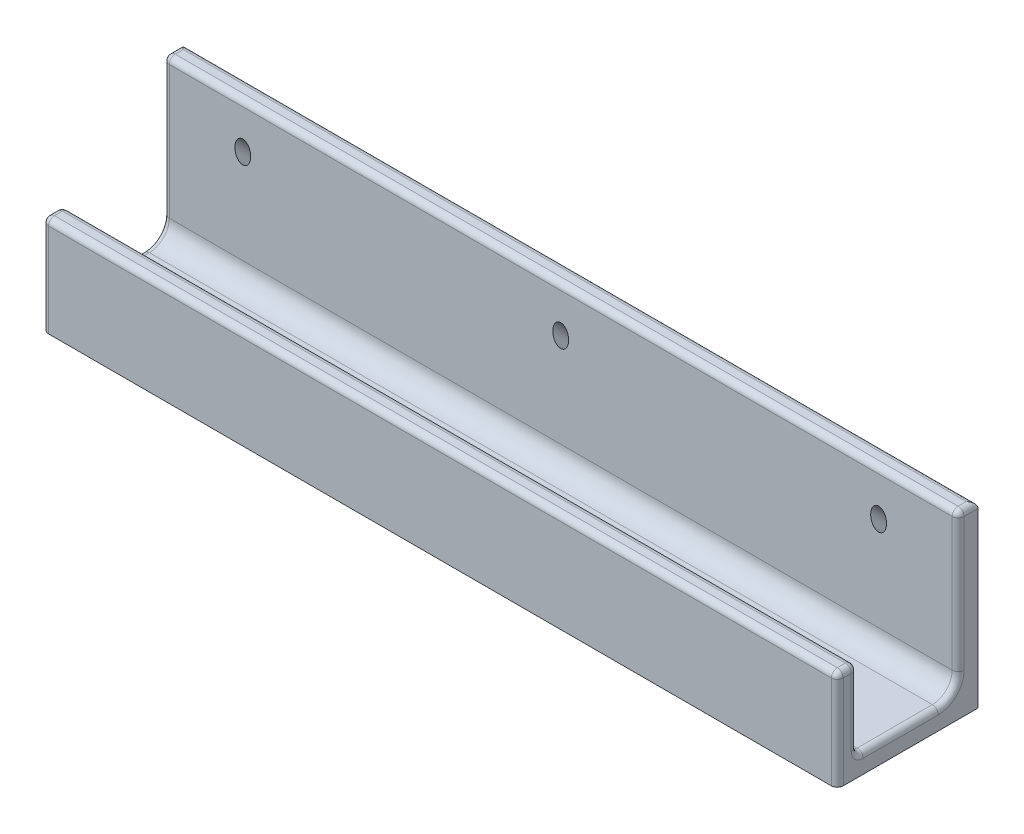
ISO-10303-21;
HEADER;
FILE_DESCRIPTION(('STEP AP214'),'2;1');
FILE_NAME('part.step','',(''),(''),'','','');
FILE_SCHEMA(('AUTOMOTIVE_DESIGN { 1 0 10303 214 1 1 1 1 }'));
ENDSEC;
DATA;
#1=APPLICATION_CONTEXT('core data for automotive mechanical design processes');
#2=APPLICATION_PROTOCOL_DEFINITION('international standard','automotive_design',2000,#1);
#3=PRODUCT_CONTEXT('',#1,'mechanical');
#4=PRODUCT('Part','Part','',(#3));
#5=PRODUCT_RELATED_PRODUCT_CATEGORY('part','',(#4));
#6=PRODUCT_DEFINITION_FORMATION('','',#4);
#7=PRODUCT_DEFINITION_CONTEXT('part definition',#1,'design');
#8=PRODUCT_DEFINITION('design','',#6,#7);
#9=PRODUCT_DEFINITION_SHAPE('','',#8);
#10=(LENGTH_UNIT() NAMED_UNIT(*) SI_UNIT(.MILLI.,.METRE.));
#11=(NAMED_UNIT(*) PLANE_ANGLE_UNIT() SI_UNIT($,.RADIAN.));
#12=(NAMED_UNIT(*) SI_UNIT($,.STERADIAN.) SOLID_ANGLE_UNIT());
#13=UNCERTAINTY_MEASURE_WITH_UNIT(LENGTH_MEASURE(1.E-05),#10,'distance_accuracy_value','');
#14=(GEOMETRIC_REPRESENTATION_CONTEXT(3) GLOBAL_UNCERTAINTY_ASSIGNED_CONTEXT((#13)) GLOBAL_UNIT_ASSIGNED_CONTEXT((#10,
#11,#12)) REPRESENTATION_CONTEXT('',''));
#15=CARTESIAN_POINT('',(0.,0.,0.));
#16=DIRECTION('',(0.,0.,1.));
#17=DIRECTION('',(1.,0.,0.));
#18=AXIS2_PLACEMENT_3D('',#15,#16,#17);
#19=CARTESIAN_POINT('',(100.,0.,-17.7));
#20=DIRECTION('',(0.,0.,1.));
#21=DIRECTION('',(1.,0.,0.));
#22=AXIS2_PLACEMENT_3D('',#19,#20,#21);
#23=PLANE('',#22);
#24=CARTESIAN_POINT('',(-80.,23.6862915010151,-17.7));
#25=DIRECTION('',(0.,0.,1.));
#26=DIRECTION('',(0.,1.,0.));
#27=AXIS2_PLACEMENT_3D('',#24,#25,#26);
#28=ELLIPSE('',#27,2.82842712474621,2.);
#29=CARTESIAN_POINT('',(-80.,26.5147186257613,-17.7));
#30=VERTEX_POINT('',#29);
#31=EDGE_CURVE('E399',#30,#30,#28,.T.);
#32=ORIENTED_EDGE('',*,*,#31,.T.);
#33=EDGE_LOOP('',(#32));
#34=FACE_BOUND('',#33,.T.);
#35=CARTESIAN_POINT('',(80.,23.6862915010152,-17.7));
#36=DIRECTION('',(0.,0.,1.));
#37=DIRECTION('',(0.,1.,0.));
#38=AXIS2_PLACEMENT_3D('',#35,#36,#37);
#39=ELLIPSE('',#38,2.82842712474621,2.);
#40=CARTESIAN_POINT('',(80.,26.5147186257614,-17.7));
#41=VERTEX_POINT('',#40);
#42=EDGE_CURVE('E409',#41,#41,#39,.T.);
#43=ORIENTED_EDGE('',*,*,#42,.T.);
#44=EDGE_LOOP('',(#43));
#45=FACE_BOUND('',#44,.T.);
#46=CARTESIAN_POINT('',(0.,23.6862915010151,-17.7));
#47=DIRECTION('',(0.,0.,1.));
#48=DIRECTION('',(0.,1.,0.));
#49=AXIS2_PLACEMENT_3D('',#46,#47,#48);
#50=ELLIPSE('',#49,2.8284271247462,2.);
#51=CARTESIAN_POINT('',(0.,26.5147186257613,-17.7));
#52=VERTEX_POINT('',#51);
#53=EDGE_CURVE('E416',#52,#52,#50,.T.);
#54=ORIENTED_EDGE('',*,*,#53,.T.);
#55=EDGE_LOOP('',(#54));
#56=FACE_BOUND('',#55,.T.);
#57=DIRECTION('',(0.,1.,0.));
#58=VECTOR('',#57,1.);
#59=CARTESIAN_POINT('',(-100.,0.,-17.7));
#60=LINE('',#59,#58);
#61=CARTESIAN_POINT('',(-100.,-5.,-17.7));
#62=VERTEX_POINT('',#61);
#63=CARTESIAN_POINT('',(-100.,38.5,-17.7));
#64=VERTEX_POINT('',#63);
#65=EDGE_CURVE('E212',#62,#64,#60,.T.);
#66=ORIENTED_EDGE('',*,*,#65,.T.);
#67=DIRECTION('',(-1.,0.,0.));
#68=VECTOR('',#67,1.);
#69=CARTESIAN_POINT('',(100.,38.5,-17.7));
#70=LINE('',#69,#68);
#71=CARTESIAN_POINT('',(100.,38.5,-17.7));
#72=VERTEX_POINT('',#71);
#73=EDGE_CURVE('E210',#64,#72,#70,.F.);
#74=ORIENTED_EDGE('',*,*,#73,.T.);
#75=DIRECTION('',(0.,1.,0.));
#76=VECTOR('',#75,1.);
#77=CARTESIAN_POINT('',(100.,0.,-17.7));
#78=LINE('',#77,#76);
#79=CARTESIAN_POINT('',(100.,-5.,-17.7));
#80=VERTEX_POINT('',#79);
#81=EDGE_CURVE('E192',#80,#72,#78,.T.);
#82=ORIENTED_EDGE('',*,*,#81,.F.);
#83=DIRECTION('',(-1.,0.,0.));
#84=VECTOR('',#83,1.);
#85=CARTESIAN_POINT('',(100.,-5.,-17.7));
#86=LINE('',#85,#84);
#87=EDGE_CURVE('E198',#80,#62,#86,.T.);
#88=ORIENTED_EDGE('',*,*,#87,.T.);
#89=EDGE_LOOP('',(#66,#74,#82,#88));
#90=FACE_BOUND('',#89,.T.);
#91=ADVANCED_FACE('F41',(#34,#45,#56,#90),#23,.F.);
#92=CARTESIAN_POINT('',(100.,40.,-12.7));
#93=DIRECTION('',(0.,1.,0.));
#94=DIRECTION('',(0.,0.,1.));
#95=AXIS2_PLACEMENT_3D('',#92,#93,#94);
#96=PLANE('',#95);
#97=DIRECTION('',(0.,0.,-1.));
#98=VECTOR('',#97,1.);
#99=CARTESIAN_POINT('',(98.5,40.,-17.7));
#100=LINE('',#99,#98);
#101=CARTESIAN_POINT('',(98.5,40.,-14.2));
#102=VERTEX_POINT('',#101);
#103=CARTESIAN_POINT('',(98.5,40.,-16.2));
#104=VERTEX_POINT('',#103);
#105=EDGE_CURVE('E293',#102,#104,#100,.T.);
#106=ORIENTED_EDGE('',*,*,#105,.T.);
#107=DIRECTION('',(-1.,0.,0.));
#108=VECTOR('',#107,1.);
#109=CARTESIAN_POINT('',(-100.,40.,-16.2));
#110=LINE('',#109,#108);
#111=CARTESIAN_POINT('',(-98.5,40.,-16.2));
#112=VERTEX_POINT('',#111);
#113=EDGE_CURVE('E295',#104,#112,#110,.T.);
#114=ORIENTED_EDGE('',*,*,#113,.T.);
#115=DIRECTION('',(0.,0.,-1.));
#116=VECTOR('',#115,1.);
#117=CARTESIAN_POINT('',(-98.5,40.,-12.7));
#118=LINE('',#117,#116);
#119=CARTESIAN_POINT('',(-98.5,40.,-14.2));
#120=VERTEX_POINT('',#119);
#121=EDGE_CURVE('E289',#112,#120,#118,.F.);
#122=ORIENTED_EDGE('',*,*,#121,.T.);
#123=DIRECTION('',(-1.,0.,0.));
#124=VECTOR('',#123,1.);
#125=CARTESIAN_POINT('',(100.,40.,-14.2));
#126=LINE('',#125,#124);
#127=EDGE_CURVE('E291',#120,#102,#126,.F.);
#128=ORIENTED_EDGE('',*,*,#127,.T.);
#129=EDGE_LOOP('',(#106,#114,#122,#128));
#130=FACE_BOUND('',#129,.T.);
#131=ADVANCED_FACE('F430',(#130),#96,.T.);
#132=CARTESIAN_POINT('',(100.,0.,-12.7));
#133=DIRECTION('',(0.,0.,1.));
#134=DIRECTION('',(1.,0.,0.));
#135=AXIS2_PLACEMENT_3D('',#132,#133,#134);
#136=PLANE('',#135);
#137=CARTESIAN_POINT('',(-80.,28.6862915010152,-12.7));
#138=DIRECTION('',(0.,0.,1.));
#139=DIRECTION('',(0.,1.,0.));
#140=AXIS2_PLACEMENT_3D('',#137,#138,#139);
#141=ELLIPSE('',#140,2.82842712474621,2.);
#142=CARTESIAN_POINT('',(-80.,31.5147186257614,-12.7));
#143=VERTEX_POINT('',#142);
#144=EDGE_CURVE('E404',#143,#143,#141,.T.);
#145=ORIENTED_EDGE('',*,*,#144,.F.);
#146=EDGE_LOOP('',(#145));
#147=FACE_BOUND('',#146,.T.);
#148=CARTESIAN_POINT('',(80.,28.6862915010152,-12.7));
#149=DIRECTION('',(0.,0.,1.));
#150=DIRECTION('',(0.,1.,0.));
#151=AXIS2_PLACEMENT_3D('',#148,#149,#150);
#152=ELLIPSE('',#151,2.82842712474621,2.);
#153=CARTESIAN_POINT('',(80.,31.5147186257614,-12.7));
#154=VERTEX_POINT('',#153);
#155=EDGE_CURVE('E414',#154,#154,#152,.T.);
#156=ORIENTED_EDGE('',*,*,#155,.F.);
#157=EDGE_LOOP('',(#156));
#158=FACE_BOUND('',#157,.T.);
#159=CARTESIAN_POINT('',(0.,28.6862915010152,-12.7));
#160=DIRECTION('',(0.,0.,1.));
#161=DIRECTION('',(0.,1.,0.));
#162=AXIS2_PLACEMENT_3D('',#159,#160,#161);
#163=ELLIPSE('',#162,2.8284271247462,2.);
#164=CARTESIAN_POINT('',(0.,31.5147186257614,-12.7));
#165=VERTEX_POINT('',#164);
#166=EDGE_CURVE('E215',#165,#165,#163,.T.);
#167=ORIENTED_EDGE('',*,*,#166,.F.);
#168=EDGE_LOOP('',(#167));
#169=FACE_BOUND('',#168,.T.);
#170=DIRECTION('',(-1.,0.,0.));
#171=VECTOR('',#170,1.);
#172=CARTESIAN_POINT('',(100.,38.5,-12.7));
#173=LINE('',#172,#171);
#174=CARTESIAN_POINT('',(98.5,38.5,-12.7));
#175=VERTEX_POINT('',#174);
#176=CARTESIAN_POINT('',(-98.5,38.5,-12.7));
#177=VERTEX_POINT('',#176);
#178=EDGE_CURVE('E301',#175,#177,#173,.T.);
#179=ORIENTED_EDGE('',*,*,#178,.T.);
#180=DIRECTION('',(0.,1.,0.));
#181=VECTOR('',#180,1.);
#182=CARTESIAN_POINT('',(-98.5,0.,-12.7));
#183=LINE('',#182,#181);
#184=CARTESIAN_POINT('',(-98.5,5.,-12.7));
#185=VERTEX_POINT('',#184);
#186=EDGE_CURVE('E303',#177,#185,#183,.F.);
#187=ORIENTED_EDGE('',*,*,#186,.T.);
#188=DIRECTION('',(-1.,0.,0.));
#189=VECTOR('',#188,1.);
#190=CARTESIAN_POINT('',(100.,5.,-12.7));
#191=LINE('',#190,#189);
#192=CARTESIAN_POINT('',(98.5,5.,-12.7));
#193=VERTEX_POINT('',#192);
#194=EDGE_CURVE('E223',#185,#193,#191,.F.);
#195=ORIENTED_EDGE('',*,*,#194,.T.);
#196=DIRECTION('',(0.,1.,0.));
#197=VECTOR('',#196,1.);
#198=CARTESIAN_POINT('',(98.5,40.,-12.7));
#199=LINE('',#198,#197);
#200=EDGE_CURVE('E299',#193,#175,#199,.T.);
#201=ORIENTED_EDGE('',*,*,#200,.T.);
#202=EDGE_LOOP('',(#179,#187,#195,#201));
#203=FACE_BOUND('',#202,.T.);
#204=ADVANCED_FACE('F426',(#147,#158,#169,#203),#136,.T.);
#205=CARTESIAN_POINT('',(100.,0.,0.));
#206=DIRECTION('',(0.,1.,0.));
#207=DIRECTION('',(0.,0.,1.));
#208=AXIS2_PLACEMENT_3D('',#205,#206,#207);
#209=PLANE('',#208);
#210=DIRECTION('',(-1.,0.,0.));
#211=VECTOR('',#210,1.);
#212=CARTESIAN_POINT('',(-100.,0.,-7.7));
#213=LINE('',#212,#211);
#214=CARTESIAN_POINT('',(98.5,0.,-7.7));
#215=VERTEX_POINT('',#214);
#216=CARTESIAN_POINT('',(-98.5,0.,-7.7));
#217=VERTEX_POINT('',#216);
#218=EDGE_CURVE('E221',#215,#217,#213,.T.);
#219=ORIENTED_EDGE('',*,*,#218,.T.);
#220=DIRECTION('',(0.,0.,-1.));
#221=VECTOR('',#220,1.);
#222=CARTESIAN_POINT('',(-98.5,0.,0.));
#223=LINE('',#222,#221);
#224=CARTESIAN_POINT('',(-98.5,0.,11.2));
#225=VERTEX_POINT('',#224);
#226=EDGE_CURVE('E11',#217,#225,#223,.F.);
#227=ORIENTED_EDGE('',*,*,#226,.T.);
#228=DIRECTION('',(-1.,0.,0.));
#229=VECTOR('',#228,1.);
#230=CARTESIAN_POINT('',(100.,0.,11.2));
#231=LINE('',#230,#229);
#232=CARTESIAN_POINT('',(98.5,0.,11.2));
#233=VERTEX_POINT('',#232);
#234=EDGE_CURVE('E50',#225,#233,#231,.F.);
#235=ORIENTED_EDGE('',*,*,#234,.T.);
#236=DIRECTION('',(0.,0.,-1.));
#237=VECTOR('',#236,1.);
#238=CARTESIAN_POINT('',(98.5,0.,-7.7));
#239=LINE('',#238,#237);
#240=EDGE_CURVE('E309',#233,#215,#239,.T.);
#241=ORIENTED_EDGE('',*,*,#240,.T.);
#242=EDGE_LOOP('',(#219,#227,#235,#241));
#243=FACE_BOUND('',#242,.T.);
#244=ADVANCED_FACE('F429',(#243),#209,.T.);
#245=CARTESIAN_POINT('',(100.,0.,12.7));
#246=DIRECTION('',(0.,0.,-1.));
#247=DIRECTION('',(-1.,0.,0.));
#248=AXIS2_PLACEMENT_3D('',#245,#246,#247);
#249=PLANE('',#248);
#250=DIRECTION('',(-1.,0.,0.));
#251=VECTOR('',#250,1.);
#252=CARTESIAN_POINT('',(-100.,1.5,12.7));
#253=LINE('',#252,#251);
#254=CARTESIAN_POINT('',(98.5,1.5,12.7));
#255=VERTEX_POINT('',#254);
#256=CARTESIAN_POINT('',(-98.5,1.5,12.7));
#257=VERTEX_POINT('',#256);
#258=EDGE_CURVE('E276',#255,#257,#253,.T.);
#259=ORIENTED_EDGE('',*,*,#258,.T.);
#260=DIRECTION('',(0.,-1.,0.));
#261=VECTOR('',#260,1.);
#262=CARTESIAN_POINT('',(-98.5,0.,12.7));
#263=LINE('',#262,#261);
#264=CARTESIAN_POINT('',(-98.5,18.5,12.7));
#265=VERTEX_POINT('',#264);
#266=EDGE_CURVE('E281',#257,#265,#263,.F.);
#267=ORIENTED_EDGE('',*,*,#266,.T.);
#268=DIRECTION('',(-1.,0.,0.));
#269=VECTOR('',#268,1.);
#270=CARTESIAN_POINT('',(100.,18.5,12.7));
#271=LINE('',#270,#269);
#272=CARTESIAN_POINT('',(98.5,18.5,12.7));
#273=VERTEX_POINT('',#272);
#274=EDGE_CURVE('E278',#265,#273,#271,.F.);
#275=ORIENTED_EDGE('',*,*,#274,.T.);
#276=DIRECTION('',(0.,-1.,0.));
#277=VECTOR('',#276,1.);
#278=CARTESIAN_POINT('',(98.5,0.,12.7));
#279=LINE('',#278,#277);
#280=EDGE_CURVE('E274',#273,#255,#279,.T.);
#281=ORIENTED_EDGE('',*,*,#280,.T.);
#282=EDGE_LOOP('',(#259,#267,#275,#281));
#283=FACE_BOUND('',#282,.T.);
#284=ADVANCED_FACE('F473',(#283),#249,.T.);
#285=CARTESIAN_POINT('',(100.,20.,17.7));
#286=DIRECTION('',(0.,1.,0.));
#287=DIRECTION('',(0.,0.,1.));
#288=AXIS2_PLACEMENT_3D('',#285,#286,#287);
#289=PLANE('',#288);
#290=DIRECTION('',(0.,0.,-1.));
#291=VECTOR('',#290,1.);
#292=CARTESIAN_POINT('',(98.5,20.,12.7));
#293=LINE('',#292,#291);
#294=CARTESIAN_POINT('',(98.5,20.,16.2));
#295=VERTEX_POINT('',#294);
#296=CARTESIAN_POINT('',(98.5,20.,14.2));
#297=VERTEX_POINT('',#296);
#298=EDGE_CURVE('E269',#295,#297,#293,.T.);
#299=ORIENTED_EDGE('',*,*,#298,.T.);
#300=DIRECTION('',(-1.,0.,0.));
#301=VECTOR('',#300,1.);
#302=CARTESIAN_POINT('',(100.,20.,14.2));
#303=LINE('',#302,#301);
#304=CARTESIAN_POINT('',(-98.5,20.,14.2));
#305=VERTEX_POINT('',#304);
#306=EDGE_CURVE('E271',#297,#305,#303,.T.);
#307=ORIENTED_EDGE('',*,*,#306,.T.);
#308=DIRECTION('',(0.,0.,-1.));
#309=VECTOR('',#308,1.);
#310=CARTESIAN_POINT('',(-98.5,20.,17.7));
#311=LINE('',#310,#309);
#312=CARTESIAN_POINT('',(-98.5,20.,16.2));
#313=VERTEX_POINT('',#312);
#314=EDGE_CURVE('E265',#305,#313,#311,.F.);
#315=ORIENTED_EDGE('',*,*,#314,.T.);
#316=DIRECTION('',(-1.,0.,0.));
#317=VECTOR('',#316,1.);
#318=CARTESIAN_POINT('',(100.,20.,16.2));
#319=LINE('',#318,#317);
#320=EDGE_CURVE('E267',#313,#295,#319,.F.);
#321=ORIENTED_EDGE('',*,*,#320,.T.);
#322=EDGE_LOOP('',(#299,#307,#315,#321));
#323=FACE_BOUND('',#322,.T.);
#324=ADVANCED_FACE('F495',(#323),#289,.T.);
#325=CARTESIAN_POINT('',(100.,0.,17.7));
#326=DIRECTION('',(0.,0.,-1.));
#327=DIRECTION('',(-1.,0.,0.));
#328=AXIS2_PLACEMENT_3D('',#325,#326,#327);
#329=PLANE('',#328);
#330=DIRECTION('',(-1.,0.,0.));
#331=VECTOR('',#330,1.);
#332=CARTESIAN_POINT('',(100.,-5.,17.7));
#333=LINE('',#332,#331);
#334=CARTESIAN_POINT('',(98.5,-5.,17.7));
#335=VERTEX_POINT('',#334);
#336=CARTESIAN_POINT('',(-98.5,-5.,17.7));
#337=VERTEX_POINT('',#336);
#338=EDGE_CURVE('E207',#335,#337,#333,.T.);
#339=ORIENTED_EDGE('',*,*,#338,.F.);
#340=DIRECTION('',(0.,-1.,0.));
#341=VECTOR('',#340,1.);
#342=CARTESIAN_POINT('',(98.5,0.,17.7));
#343=LINE('',#342,#341);
#344=CARTESIAN_POINT('',(98.5,18.5,17.7));
#345=VERTEX_POINT('',#344);
#346=EDGE_CURVE('E287',#335,#345,#343,.F.);
#347=ORIENTED_EDGE('',*,*,#346,.T.);
#348=DIRECTION('',(-1.,0.,0.));
#349=VECTOR('',#348,1.);
#350=CARTESIAN_POINT('',(-100.,18.5,17.7));
#351=LINE('',#350,#349);
#352=CARTESIAN_POINT('',(-98.5,18.5,17.7));
#353=VERTEX_POINT('',#352);
#354=EDGE_CURVE('E285',#345,#353,#351,.T.);
#355=ORIENTED_EDGE('',*,*,#354,.T.);
#356=DIRECTION('',(0.,-1.,0.));
#357=VECTOR('',#356,1.);
#358=CARTESIAN_POINT('',(-98.5,-5.,17.7));
#359=LINE('',#358,#357);
#360=EDGE_CURVE('E283',#353,#337,#359,.T.);
#361=ORIENTED_EDGE('',*,*,#360,.T.);
#362=EDGE_LOOP('',(#339,#347,#355,#361));
#363=FACE_BOUND('',#362,.T.);
#364=ADVANCED_FACE('F868',(#363),#329,.F.);
#365=CARTESIAN_POINT('',(100.,-5.,0.));
#366=DIRECTION('',(0.,1.,0.));
#367=DIRECTION('',(0.,0.,1.));
#368=AXIS2_PLACEMENT_3D('',#365,#366,#367);
#369=PLANE('',#368);
#370=DIRECTION('',(0.,0.,-1.));
#371=VECTOR('',#370,1.);
#372=CARTESIAN_POINT('',(100.,-5.,0.));
#373=LINE('',#372,#371);
#374=CARTESIAN_POINT('',(100.,-5.,16.2));
#375=VERTEX_POINT('',#374);
#376=EDGE_CURVE('E188',#375,#80,#373,.T.);
#377=ORIENTED_EDGE('',*,*,#376,.F.);
#378=CARTESIAN_POINT('',(98.5,-5.,16.2));
#379=DIRECTION('',(0.,1.,0.));
#380=DIRECTION('',(0.,0.,1.));
#381=AXIS2_PLACEMENT_3D('',#378,#379,#380);
#382=CIRCLE('',#381,1.5);
#383=EDGE_CURVE('E307',#375,#335,#382,.F.);
#384=ORIENTED_EDGE('',*,*,#383,.T.);
#385=ORIENTED_EDGE('',*,*,#338,.T.);
#386=CARTESIAN_POINT('',(-98.5,-5.,16.2));
#387=DIRECTION('',(0.,1.,0.));
#388=DIRECTION('',(0.,0.,1.));
#389=AXIS2_PLACEMENT_3D('',#386,#387,#388);
#390=CIRCLE('',#389,1.5);
#391=CARTESIAN_POINT('',(-100.,-5.,16.2));
#392=VERTEX_POINT('',#391);
#393=EDGE_CURVE('E305',#337,#392,#390,.F.);
#394=ORIENTED_EDGE('',*,*,#393,.T.);
#395=DIRECTION('',(0.,0.,-1.));
#396=VECTOR('',#395,1.);
#397=CARTESIAN_POINT('',(-100.,-5.,0.));
#398=LINE('',#397,#396);
#399=EDGE_CURVE('E203',#392,#62,#398,.T.);
#400=ORIENTED_EDGE('',*,*,#399,.T.);
#401=ORIENTED_EDGE('',*,*,#87,.F.);
#402=EDGE_LOOP('',(#377,#384,#385,#394,#400,#401));
#403=FACE_BOUND('',#402,.T.);
#404=ADVANCED_FACE('F201',(#403),#369,.F.);
#405=CARTESIAN_POINT('',(100.,0.,0.));
#406=DIRECTION('',(-1.,0.,0.));
#407=DIRECTION('',(0.,0.,1.));
#408=AXIS2_PLACEMENT_3D('',#405,#406,#407);
#409=PLANE('',#408);
#410=DIRECTION('',(0.,0.,-1.));
#411=VECTOR('',#410,1.);
#412=CARTESIAN_POINT('',(100.,18.5,17.7));
#413=LINE('',#412,#411);
#414=CARTESIAN_POINT('',(100.,18.5,14.2));
#415=VERTEX_POINT('',#414);
#416=CARTESIAN_POINT('',(100.,18.5,16.2));
#417=VERTEX_POINT('',#416);
#418=EDGE_CURVE('E262',#415,#417,#413,.F.);
#419=ORIENTED_EDGE('',*,*,#418,.T.);
#420=DIRECTION('',(0.,-1.,0.));
#421=VECTOR('',#420,1.);
#422=CARTESIAN_POINT('',(100.,0.,16.2));
#423=LINE('',#422,#421);
#424=EDGE_CURVE('E195',#417,#375,#423,.T.);
#425=ORIENTED_EDGE('',*,*,#424,.T.);
#426=ORIENTED_EDGE('',*,*,#376,.T.);
#427=ORIENTED_EDGE('',*,*,#81,.T.);
#428=DIRECTION('',(0.,0.,-1.));
#429=VECTOR('',#428,1.);
#430=CARTESIAN_POINT('',(100.,38.5,-12.7));
#431=LINE('',#430,#429);
#432=CARTESIAN_POINT('',(100.,38.5,-14.2));
#433=VERTEX_POINT('',#432);
#434=EDGE_CURVE('E251',#72,#433,#431,.F.);
#435=ORIENTED_EDGE('',*,*,#434,.T.);
#436=DIRECTION('',(0.,1.,0.));
#437=VECTOR('',#436,1.);
#438=CARTESIAN_POINT('',(100.,5.,-14.2));
#439=LINE('',#438,#437);
#440=CARTESIAN_POINT('',(100.,5.,-14.2));
#441=VERTEX_POINT('',#440);
#442=EDGE_CURVE('E249',#433,#441,#439,.F.);
#443=ORIENTED_EDGE('',*,*,#442,.T.);
#444=CARTESIAN_POINT('',(100.,5.,-7.7));
#445=DIRECTION('',(-1.,0.,0.));
#446=DIRECTION('',(0.,0.,1.));
#447=AXIS2_PLACEMENT_3D('',#444,#445,#446);
#448=CIRCLE('',#447,6.5);
#449=CARTESIAN_POINT('',(100.,-1.5,-7.7));
#450=VERTEX_POINT('',#449);
#451=EDGE_CURVE('E253',#441,#450,#448,.T.);
#452=ORIENTED_EDGE('',*,*,#451,.T.);
#453=DIRECTION('',(0.,0.,-1.));
#454=VECTOR('',#453,1.);
#455=CARTESIAN_POINT('',(100.,-1.5,12.7));
#456=LINE('',#455,#454);
#457=CARTESIAN_POINT('',(100.,-1.5,11.2));
#458=VERTEX_POINT('',#457);
#459=EDGE_CURVE('E255',#450,#458,#456,.F.);
#460=ORIENTED_EDGE('',*,*,#459,.T.);
#461=CARTESIAN_POINT('',(100.,1.5,11.2));
#462=DIRECTION('',(-1.,0.,0.));
#463=DIRECTION('',(0.,0.,1.));
#464=AXIS2_PLACEMENT_3D('',#461,#462,#463);
#465=CIRCLE('',#464,3.);
#466=CARTESIAN_POINT('',(100.,1.5,14.2));
#467=VERTEX_POINT('',#466);
#468=EDGE_CURVE('E257',#467,#458,#465,.F.);
#469=ORIENTED_EDGE('',*,*,#468,.F.);
#470=DIRECTION('',(0.,-1.,0.));
#471=VECTOR('',#470,1.);
#472=CARTESIAN_POINT('',(100.,20.,14.2));
#473=LINE('',#472,#471);
#474=EDGE_CURVE('E260',#467,#415,#473,.F.);
#475=ORIENTED_EDGE('',*,*,#474,.T.);
#476=EDGE_LOOP('',(#419,#425,#426,#427,#435,#443,#452,#460,#469,#475));
#477=FACE_BOUND('',#476,.T.);
#478=ADVANCED_FACE('F190',(#477),#409,.F.);
#479=CARTESIAN_POINT('',(-100.,0.,0.));
#480=DIRECTION('',(-1.,0.,0.));
#481=DIRECTION('',(0.,0.,1.));
#482=AXIS2_PLACEMENT_3D('',#479,#480,#481);
#483=PLANE('',#482);
#484=DIRECTION('',(0.,1.,0.));
#485=VECTOR('',#484,1.);
#486=CARTESIAN_POINT('',(-100.,0.,-14.2));
#487=LINE('',#486,#485);
#488=CARTESIAN_POINT('',(-100.,5.,-14.2));
#489=VERTEX_POINT('',#488);
#490=CARTESIAN_POINT('',(-100.,38.5,-14.2));
#491=VERTEX_POINT('',#490);
#492=EDGE_CURVE('E240',#489,#491,#487,.T.);
#493=ORIENTED_EDGE('',*,*,#492,.T.);
#494=DIRECTION('',(0.,0.,-1.));
#495=VECTOR('',#494,1.);
#496=CARTESIAN_POINT('',(-100.,38.5,0.));
#497=LINE('',#496,#495);
#498=EDGE_CURVE('E242',#491,#64,#497,.T.);
#499=ORIENTED_EDGE('',*,*,#498,.T.);
#500=ORIENTED_EDGE('',*,*,#65,.F.);
#501=ORIENTED_EDGE('',*,*,#399,.F.);
#502=DIRECTION('',(0.,-1.,0.));
#503=VECTOR('',#502,1.);
#504=CARTESIAN_POINT('',(-100.,20.,16.2));
#505=LINE('',#504,#503);
#506=CARTESIAN_POINT('',(-100.,18.5,16.2));
#507=VERTEX_POINT('',#506);
#508=EDGE_CURVE('E238',#392,#507,#505,.F.);
#509=ORIENTED_EDGE('',*,*,#508,.T.);
#510=DIRECTION('',(0.,0.,-1.));
#511=VECTOR('',#510,1.);
#512=CARTESIAN_POINT('',(-100.,18.5,0.));
#513=LINE('',#512,#511);
#514=CARTESIAN_POINT('',(-100.,18.5,14.2));
#515=VERTEX_POINT('',#514);
#516=EDGE_CURVE('E233',#507,#515,#513,.T.);
#517=ORIENTED_EDGE('',*,*,#516,.T.);
#518=DIRECTION('',(0.,-1.,0.));
#519=VECTOR('',#518,1.);
#520=CARTESIAN_POINT('',(-100.,0.,14.2));
#521=LINE('',#520,#519);
#522=CARTESIAN_POINT('',(-100.,1.5,14.2));
#523=VERTEX_POINT('',#522);
#524=EDGE_CURVE('E229',#515,#523,#521,.T.);
#525=ORIENTED_EDGE('',*,*,#524,.T.);
#526=CARTESIAN_POINT('',(-100.,1.5,11.2));
#527=DIRECTION('',(-1.,0.,0.));
#528=DIRECTION('',(0.,0.,1.));
#529=AXIS2_PLACEMENT_3D('',#526,#527,#528);
#530=CIRCLE('',#529,3.);
#531=CARTESIAN_POINT('',(-100.,-1.5,11.2));
#532=VERTEX_POINT('',#531);
#533=EDGE_CURVE('E226',#532,#523,#530,.T.);
#534=ORIENTED_EDGE('',*,*,#533,.F.);
#535=DIRECTION('',(0.,0.,-1.));
#536=VECTOR('',#535,1.);
#537=CARTESIAN_POINT('',(-100.,-1.5,0.));
#538=LINE('',#537,#536);
#539=CARTESIAN_POINT('',(-100.,-1.5,-7.7));
#540=VERTEX_POINT('',#539);
#541=EDGE_CURVE('E231',#532,#540,#538,.T.);
#542=ORIENTED_EDGE('',*,*,#541,.T.);
#543=CARTESIAN_POINT('',(-100.,5.,-7.7));
#544=DIRECTION('',(-1.,0.,0.));
#545=DIRECTION('',(0.,0.,1.));
#546=AXIS2_PLACEMENT_3D('',#543,#544,#545);
#547=CIRCLE('',#546,6.5);
#548=EDGE_CURVE('E235',#540,#489,#547,.F.);
#549=ORIENTED_EDGE('',*,*,#548,.T.);
#550=EDGE_LOOP('',(#493,#499,#500,#501,#509,#517,#525,#534,#542,#549));
#551=FACE_BOUND('',#550,.T.);
#552=ADVANCED_FACE('F840',(#551),#483,.T.);
#553=CARTESIAN_POINT('',(0.,34.3431457505077,-7.04314575050759));
#554=DIRECTION('',(0.,0.707106781186551,0.707106781186544));
#555=DIRECTION('',(0.,-0.707106781186544,0.707106781186551));
#556=AXIS2_PLACEMENT_3D('',#553,#554,#555);
#557=CYLINDRICAL_SURFACE('',#556,2.);
#558=ORIENTED_EDGE('',*,*,#166,.T.);
#559=EDGE_LOOP('',(#558));
#560=FACE_BOUND('',#559,.T.);
#561=ORIENTED_EDGE('',*,*,#53,.F.);
#562=EDGE_LOOP('',(#561));
#563=FACE_BOUND('',#562,.T.);
#564=ADVANCED_FACE('F423',(#560,#563),#557,.F.);
#565=CARTESIAN_POINT('',(80.,34.3431457505077,-7.0431457505076));
#566=DIRECTION('',(0.,0.707106781186551,0.707106781186544));
#567=DIRECTION('',(0.,-0.707106781186544,0.707106781186551));
#568=AXIS2_PLACEMENT_3D('',#565,#566,#567);
#569=CYLINDRICAL_SURFACE('',#568,2.);
#570=ORIENTED_EDGE('',*,*,#155,.T.);
#571=EDGE_LOOP('',(#570));
#572=FACE_BOUND('',#571,.T.);
#573=ORIENTED_EDGE('',*,*,#42,.F.);
#574=EDGE_LOOP('',(#573));
#575=FACE_BOUND('',#574,.T.);
#576=ADVANCED_FACE('F819',(#572,#575),#569,.F.);
#577=CARTESIAN_POINT('',(-80.,34.3431457505077,-7.04314575050759));
#578=DIRECTION('',(0.,0.707106781186551,0.707106781186544));
#579=DIRECTION('',(0.,-0.707106781186544,0.707106781186551));
#580=AXIS2_PLACEMENT_3D('',#577,#578,#579);
#581=CYLINDRICAL_SURFACE('',#580,2.);
#582=ORIENTED_EDGE('',*,*,#144,.T.);
#583=EDGE_LOOP('',(#582));
#584=FACE_BOUND('',#583,.T.);
#585=ORIENTED_EDGE('',*,*,#31,.F.);
#586=EDGE_LOOP('',(#585));
#587=FACE_BOUND('',#586,.T.);
#588=ADVANCED_FACE('F546',(#584,#587),#581,.F.);
#589=CARTESIAN_POINT('',(100.,5.,-7.7));
#590=DIRECTION('',(1.,0.,0.));
#591=DIRECTION('',(0.,0.,-1.));
#592=AXIS2_PLACEMENT_3D('',#589,#590,#591);
#593=CYLINDRICAL_SURFACE('',#592,5.);
#594=ORIENTED_EDGE('',*,*,#194,.F.);
#595=CARTESIAN_POINT('',(-98.5,5.,-7.7));
#596=DIRECTION('',(-1.,0.,0.));
#597=DIRECTION('',(0.,0.,1.));
#598=AXIS2_PLACEMENT_3D('',#595,#596,#597);
#599=CIRCLE('',#598,5.);
#600=EDGE_CURVE('E246',#185,#217,#599,.T.);
#601=ORIENTED_EDGE('',*,*,#600,.T.);
#602=ORIENTED_EDGE('',*,*,#218,.F.);
#603=CARTESIAN_POINT('',(98.5,5.,-7.7));
#604=DIRECTION('',(-1.,0.,0.));
#605=DIRECTION('',(0.,0.,1.));
#606=AXIS2_PLACEMENT_3D('',#603,#604,#605);
#607=CIRCLE('',#606,5.);
#608=EDGE_CURVE('E244',#215,#193,#607,.F.);
#609=ORIENTED_EDGE('',*,*,#608,.T.);
#610=EDGE_LOOP('',(#594,#601,#602,#609));
#611=FACE_BOUND('',#610,.T.);
#612=ADVANCED_FACE('F457',(#611),#593,.F.);
#613=CARTESIAN_POINT('',(98.5,0.,16.2));
#614=DIRECTION('',(0.,-1.,0.));
#615=DIRECTION('',(0.,0.,-1.));
#616=AXIS2_PLACEMENT_3D('',#613,#614,#615);
#617=CYLINDRICAL_SURFACE('',#616,1.5);
#618=CARTESIAN_POINT('',(98.5,18.5,16.2));
#619=DIRECTION('',(0.,1.,0.));
#620=DIRECTION('',(0.,0.,1.));
#621=AXIS2_PLACEMENT_3D('',#618,#619,#620);
#622=CIRCLE('',#621,1.5);
#623=EDGE_CURVE('E45',#345,#417,#622,.T.);
#624=ORIENTED_EDGE('',*,*,#623,.F.);
#625=ORIENTED_EDGE('',*,*,#346,.F.);
#626=ORIENTED_EDGE('',*,*,#383,.F.);
#627=ORIENTED_EDGE('',*,*,#424,.F.);
#628=EDGE_LOOP('',(#624,#625,#626,#627));
#629=FACE_BOUND('',#628,.T.);
#630=ADVANCED_FACE('F43',(#629),#617,.T.);
#631=CARTESIAN_POINT('',(98.5,18.5,16.2));
#632=DIRECTION('',(1.,0.,0.));
#633=DIRECTION('',(0.,0.,-1.));
#634=AXIS2_PLACEMENT_3D('',#631,#632,#633);
#635=SPHERICAL_SURFACE('',#634,1.5);
#636=CARTESIAN_POINT('',(98.5,18.5,16.2));
#637=DIRECTION('',(1.,0.,0.));
#638=DIRECTION('',(0.,0.,-1.));
#639=AXIS2_PLACEMENT_3D('',#636,#637,#638);
#640=CIRCLE('',#639,1.5);
#641=EDGE_CURVE('E390',#345,#295,#640,.F.);
#642=ORIENTED_EDGE('',*,*,#641,.F.);
#643=ORIENTED_EDGE('',*,*,#623,.T.);
#644=CARTESIAN_POINT('',(98.5,18.5,16.2));
#645=DIRECTION('',(0.,0.,1.));
#646=DIRECTION('',(1.,0.,0.));
#647=AXIS2_PLACEMENT_3D('',#644,#645,#646);
#648=CIRCLE('',#647,1.5);
#649=EDGE_CURVE('E392',#295,#417,#648,.F.);
#650=ORIENTED_EDGE('',*,*,#649,.F.);
#651=EDGE_LOOP('',(#642,#643,#650));
#652=FACE_BOUND('',#651,.T.);
#653=ADVANCED_FACE('F784',(#652),#635,.T.);
#654=CARTESIAN_POINT('',(98.5,18.5,17.7));
#655=DIRECTION('',(0.,0.,1.));
#656=DIRECTION('',(1.,0.,0.));
#657=AXIS2_PLACEMENT_3D('',#654,#655,#656);
#658=CYLINDRICAL_SURFACE('',#657,1.5);
#659=ORIENTED_EDGE('',*,*,#649,.T.);
#660=ORIENTED_EDGE('',*,*,#418,.F.);
#661=CARTESIAN_POINT('',(98.5,18.5,14.2));
#662=DIRECTION('',(0.,0.,-1.));
#663=DIRECTION('',(-1.,0.,0.));
#664=AXIS2_PLACEMENT_3D('',#661,#662,#663);
#665=CIRCLE('',#664,1.5);
#666=EDGE_CURVE('E387',#297,#415,#665,.T.);
#667=ORIENTED_EDGE('',*,*,#666,.F.);
#668=ORIENTED_EDGE('',*,*,#298,.F.);
#669=EDGE_LOOP('',(#659,#660,#667,#668));
#670=FACE_BOUND('',#669,.T.);
#671=ADVANCED_FACE('F498',(#670),#658,.T.);
#672=CARTESIAN_POINT('',(100.,18.5,16.2));
#673=DIRECTION('',(1.,0.,0.));
#674=DIRECTION('',(0.,0.,-1.));
#675=AXIS2_PLACEMENT_3D('',#672,#673,#674);
#676=CYLINDRICAL_SURFACE('',#675,1.5);
#677=ORIENTED_EDGE('',*,*,#641,.T.);
#678=ORIENTED_EDGE('',*,*,#320,.F.);
#679=CARTESIAN_POINT('',(-98.5,18.5,16.2));
#680=DIRECTION('',(-1.,0.,0.));
#681=DIRECTION('',(0.,0.,1.));
#682=AXIS2_PLACEMENT_3D('',#679,#680,#681);
#683=CIRCLE('',#682,1.5);
#684=EDGE_CURVE('E384',#353,#313,#683,.T.);
#685=ORIENTED_EDGE('',*,*,#684,.F.);
#686=ORIENTED_EDGE('',*,*,#354,.F.);
#687=EDGE_LOOP('',(#677,#678,#685,#686));
#688=FACE_BOUND('',#687,.T.);
#689=ADVANCED_FACE('F763',(#688),#676,.T.);
#690=CARTESIAN_POINT('',(-98.5,0.,16.2));
#691=DIRECTION('',(0.,1.,0.));
#692=DIRECTION('',(0.,0.,1.));
#693=AXIS2_PLACEMENT_3D('',#690,#691,#692);
#694=CYLINDRICAL_SURFACE('',#693,1.5);
#695=ORIENTED_EDGE('',*,*,#393,.F.);
#696=ORIENTED_EDGE('',*,*,#360,.F.);
#697=CARTESIAN_POINT('',(-98.5,18.5,16.2));
#698=DIRECTION('',(0.,1.,0.));
#699=DIRECTION('',(0.,0.,1.));
#700=AXIS2_PLACEMENT_3D('',#697,#698,#699);
#701=CIRCLE('',#700,1.5);
#702=EDGE_CURVE('E381',#507,#353,#701,.T.);
#703=ORIENTED_EDGE('',*,*,#702,.F.);
#704=ORIENTED_EDGE('',*,*,#508,.F.);
#705=EDGE_LOOP('',(#695,#696,#703,#704));
#706=FACE_BOUND('',#705,.T.);
#707=ADVANCED_FACE('F753',(#706),#694,.T.);
#708=CARTESIAN_POINT('',(98.5,18.5,14.2));
#709=DIRECTION('',(1.,0.,0.));
#710=DIRECTION('',(0.,0.,-1.));
#711=AXIS2_PLACEMENT_3D('',#708,#709,#710);
#712=SPHERICAL_SURFACE('',#711,1.5);
#713=CARTESIAN_POINT('',(98.5,18.5,14.2));
#714=DIRECTION('',(1.,0.,0.));
#715=DIRECTION('',(0.,0.,-1.));
#716=AXIS2_PLACEMENT_3D('',#713,#714,#715);
#717=CIRCLE('',#716,1.5);
#718=EDGE_CURVE('E372',#297,#273,#717,.F.);
#719=ORIENTED_EDGE('',*,*,#718,.F.);
#720=ORIENTED_EDGE('',*,*,#666,.T.);
#721=CARTESIAN_POINT('',(98.5,18.5,14.2));
#722=DIRECTION('',(0.,1.,0.));
#723=DIRECTION('',(0.,0.,1.));
#724=AXIS2_PLACEMENT_3D('',#721,#722,#723);
#725=CIRCLE('',#724,1.5);
#726=EDGE_CURVE('E375',#273,#415,#725,.F.);
#727=ORIENTED_EDGE('',*,*,#726,.F.);
#728=EDGE_LOOP('',(#719,#720,#727));
#729=FACE_BOUND('',#728,.T.);
#730=ADVANCED_FACE('F501',(#729),#712,.T.);
#731=CARTESIAN_POINT('',(-98.5,18.5,16.2));
#732=DIRECTION('',(0.,0.,1.));
#733=DIRECTION('',(1.,0.,0.));
#734=AXIS2_PLACEMENT_3D('',#731,#732,#733);
#735=SPHERICAL_SURFACE('',#734,1.5);
#736=ORIENTED_EDGE('',*,*,#702,.T.);
#737=ORIENTED_EDGE('',*,*,#684,.T.);
#738=CARTESIAN_POINT('',(-98.5,18.5,16.2));
#739=DIRECTION('',(0.,0.,1.));
#740=DIRECTION('',(1.,0.,0.));
#741=AXIS2_PLACEMENT_3D('',#738,#739,#740);
#742=CIRCLE('',#741,1.5);
#743=EDGE_CURVE('E369',#507,#313,#742,.F.);
#744=ORIENTED_EDGE('',*,*,#743,.F.);
#745=EDGE_LOOP('',(#736,#737,#744));
#746=FACE_BOUND('',#745,.T.);
#747=ADVANCED_FACE('F732',(#746),#735,.T.);
#748=CARTESIAN_POINT('',(98.5,5.,-7.7));
#749=DIRECTION('',(-1.,0.,0.));
#750=DIRECTION('',(0.,0.,1.));
#751=AXIS2_PLACEMENT_3D('',#748,#749,#750);
#752=TOROIDAL_SURFACE('',#751,6.5,1.5);
#753=CARTESIAN_POINT('',(98.5,5.,-14.2));
#754=DIRECTION('',(0.,1.,0.));
#755=DIRECTION('',(0.,0.,1.));
#756=AXIS2_PLACEMENT_3D('',#753,#754,#755);
#757=CIRCLE('',#756,1.5);
#758=EDGE_CURVE('E366',#193,#441,#757,.T.);
#759=ORIENTED_EDGE('',*,*,#758,.F.);
#760=ORIENTED_EDGE('',*,*,#608,.F.);
#761=CARTESIAN_POINT('',(98.5,-1.5,-7.7));
#762=DIRECTION('',(0.,0.,1.));
#763=DIRECTION('',(1.,0.,0.));
#764=AXIS2_PLACEMENT_3D('',#761,#762,#763);
#765=CIRCLE('',#764,1.5);
#766=EDGE_CURVE('E378',#450,#215,#765,.T.);
#767=ORIENTED_EDGE('',*,*,#766,.F.);
#768=ORIENTED_EDGE('',*,*,#451,.F.);
#769=EDGE_LOOP('',(#759,#760,#767,#768));
#770=FACE_BOUND('',#769,.T.);
#771=ADVANCED_FACE('F509',(#770),#752,.T.);
#772=CARTESIAN_POINT('',(98.5,-1.5,0.));
#773=DIRECTION('',(0.,0.,1.));
#774=DIRECTION('',(1.,0.,0.));
#775=AXIS2_PLACEMENT_3D('',#772,#773,#774);
#776=CYLINDRICAL_SURFACE('',#775,1.5);
#777=ORIENTED_EDGE('',*,*,#766,.T.);
#778=ORIENTED_EDGE('',*,*,#240,.F.);
#779=CARTESIAN_POINT('',(98.5,-1.5,11.2));
#780=DIRECTION('',(0.,0.,1.));
#781=DIRECTION('',(1.,0.,0.));
#782=AXIS2_PLACEMENT_3D('',#779,#780,#781);
#783=CIRCLE('',#782,1.5);
#784=EDGE_CURVE('E363',#458,#233,#783,.T.);
#785=ORIENTED_EDGE('',*,*,#784,.F.);
#786=ORIENTED_EDGE('',*,*,#459,.F.);
#787=EDGE_LOOP('',(#777,#778,#785,#786));
#788=FACE_BOUND('',#787,.T.);
#789=ADVANCED_FACE('F461',(#788),#776,.T.);
#790=CARTESIAN_POINT('',(98.5,0.,14.2));
#791=DIRECTION('',(0.,1.,0.));
#792=DIRECTION('',(0.,0.,1.));
#793=AXIS2_PLACEMENT_3D('',#790,#791,#792);
#794=CYLINDRICAL_SURFACE('',#793,1.5);
#795=ORIENTED_EDGE('',*,*,#726,.T.);
#796=ORIENTED_EDGE('',*,*,#474,.F.);
#797=CARTESIAN_POINT('',(98.5,1.5,14.2));
#798=DIRECTION('',(0.,-1.,0.));
#799=DIRECTION('',(0.,0.,-1.));
#800=AXIS2_PLACEMENT_3D('',#797,#798,#799);
#801=CIRCLE('',#800,1.5);
#802=EDGE_CURVE('E360',#255,#467,#801,.T.);
#803=ORIENTED_EDGE('',*,*,#802,.F.);
#804=ORIENTED_EDGE('',*,*,#280,.F.);
#805=EDGE_LOOP('',(#795,#796,#803,#804));
#806=FACE_BOUND('',#805,.T.);
#807=ADVANCED_FACE('F504',(#806),#794,.T.);
#808=CARTESIAN_POINT('',(100.,18.5,14.2));
#809=DIRECTION('',(-1.,0.,0.));
#810=DIRECTION('',(0.,0.,1.));
#811=AXIS2_PLACEMENT_3D('',#808,#809,#810);
#812=CYLINDRICAL_SURFACE('',#811,1.5);
#813=ORIENTED_EDGE('',*,*,#718,.T.);
#814=ORIENTED_EDGE('',*,*,#274,.F.);
#815=CARTESIAN_POINT('',(-98.5,18.5,14.2));
#816=DIRECTION('',(-1.,0.,0.));
#817=DIRECTION('',(0.,0.,1.));
#818=AXIS2_PLACEMENT_3D('',#815,#816,#817);
#819=CIRCLE('',#818,1.5);
#820=EDGE_CURVE('E357',#305,#265,#819,.T.);
#821=ORIENTED_EDGE('',*,*,#820,.F.);
#822=ORIENTED_EDGE('',*,*,#306,.F.);
#823=EDGE_LOOP('',(#813,#814,#821,#822));
#824=FACE_BOUND('',#823,.T.);
#825=ADVANCED_FACE('F488',(#824),#812,.T.);
#826=CARTESIAN_POINT('',(-98.5,18.5,0.));
#827=DIRECTION('',(0.,0.,-1.));
#828=DIRECTION('',(-1.,0.,0.));
#829=AXIS2_PLACEMENT_3D('',#826,#827,#828);
#830=CYLINDRICAL_SURFACE('',#829,1.5);
#831=ORIENTED_EDGE('',*,*,#743,.T.);
#832=ORIENTED_EDGE('',*,*,#314,.F.);
#833=CARTESIAN_POINT('',(-98.5,18.5,14.2));
#834=DIRECTION('',(0.,0.,-1.));
#835=DIRECTION('',(-1.,0.,0.));
#836=AXIS2_PLACEMENT_3D('',#833,#834,#835);
#837=CIRCLE('',#836,1.5);
#838=EDGE_CURVE('E355',#515,#305,#837,.T.);
#839=ORIENTED_EDGE('',*,*,#838,.F.);
#840=ORIENTED_EDGE('',*,*,#516,.F.);
#841=EDGE_LOOP('',(#831,#832,#839,#840));
#842=FACE_BOUND('',#841,.T.);
#843=ADVANCED_FACE('F490',(#842),#830,.T.);
#844=CARTESIAN_POINT('',(98.5,38.5,-12.7));
#845=DIRECTION('',(0.,0.,1.));
#846=DIRECTION('',(1.,0.,0.));
#847=AXIS2_PLACEMENT_3D('',#844,#845,#846);
#848=CYLINDRICAL_SURFACE('',#847,1.5);
#849=CARTESIAN_POINT('',(98.5,38.5,-14.2));
#850=DIRECTION('',(0.,0.,1.));
#851=DIRECTION('',(1.,0.,0.));
#852=AXIS2_PLACEMENT_3D('',#849,#850,#851);
#853=CIRCLE('',#852,1.5);
#854=EDGE_CURVE('E349',#433,#102,#853,.T.);
#855=ORIENTED_EDGE('',*,*,#854,.F.);
#856=ORIENTED_EDGE('',*,*,#434,.F.);
#857=CARTESIAN_POINT('',(98.5,38.5,-16.2));
#858=DIRECTION('',(0.707106781186547,0.,0.707106781186547));
#859=DIRECTION('',(-0.707106781186547,0.,0.707106781186547));
#860=AXIS2_PLACEMENT_3D('',#857,#858,#859);
#861=ELLIPSE('',#860,2.12132034355964,1.5);
#862=EDGE_CURVE('E352',#104,#72,#861,.F.);
#863=ORIENTED_EDGE('',*,*,#862,.F.);
#864=ORIENTED_EDGE('',*,*,#105,.F.);
#865=EDGE_LOOP('',(#855,#856,#863,#864));
#866=FACE_BOUND('',#865,.T.);
#867=ADVANCED_FACE('F518',(#866),#848,.T.);
#868=CARTESIAN_POINT('',(98.5,0.,-14.2));
#869=DIRECTION('',(0.,-1.,0.));
#870=DIRECTION('',(0.,0.,-1.));
#871=AXIS2_PLACEMENT_3D('',#868,#869,#870);
#872=CYLINDRICAL_SURFACE('',#871,1.5);
#873=ORIENTED_EDGE('',*,*,#758,.T.);
#874=ORIENTED_EDGE('',*,*,#442,.F.);
#875=CARTESIAN_POINT('',(98.5,38.5,-14.2));
#876=DIRECTION('',(0.,1.,0.));
#877=DIRECTION('',(0.,0.,1.));
#878=AXIS2_PLACEMENT_3D('',#875,#876,#877);
#879=CIRCLE('',#878,1.5);
#880=EDGE_CURVE('E346',#175,#433,#879,.T.);
#881=ORIENTED_EDGE('',*,*,#880,.F.);
#882=ORIENTED_EDGE('',*,*,#200,.F.);
#883=EDGE_LOOP('',(#873,#874,#881,#882));
#884=FACE_BOUND('',#883,.T.);
#885=ADVANCED_FACE('F511',(#884),#872,.T.);
#886=CARTESIAN_POINT('',(98.5,1.5,11.2));
#887=DIRECTION('',(-1.,0.,0.));
#888=DIRECTION('',(0.,0.,1.));
#889=AXIS2_PLACEMENT_3D('',#886,#887,#888);
#890=TOROIDAL_SURFACE('',#889,3.,1.5);
#891=ORIENTED_EDGE('',*,*,#468,.T.);
#892=ORIENTED_EDGE('',*,*,#784,.T.);
#893=CARTESIAN_POINT('',(98.5,1.5,11.2));
#894=DIRECTION('',(-1.,0.,0.));
#895=DIRECTION('',(0.,0.,1.));
#896=AXIS2_PLACEMENT_3D('',#893,#894,#895);
#897=CIRCLE('',#896,1.5);
#898=EDGE_CURVE('E343',#255,#233,#897,.F.);
#899=ORIENTED_EDGE('',*,*,#898,.F.);
#900=ORIENTED_EDGE('',*,*,#802,.T.);
#901=EDGE_LOOP('',(#891,#892,#899,#900));
#902=FACE_BOUND('',#901,.T.);
#903=ADVANCED_FACE('F466',(#902),#890,.T.);
#904=CARTESIAN_POINT('',(-98.5,18.5,14.2));
#905=DIRECTION('',(0.,1.,0.));
#906=DIRECTION('',(0.,0.,1.));
#907=AXIS2_PLACEMENT_3D('',#904,#905,#906);
#908=SPHERICAL_SURFACE('',#907,1.5);
#909=ORIENTED_EDGE('',*,*,#838,.T.);
#910=ORIENTED_EDGE('',*,*,#820,.T.);
#911=CARTESIAN_POINT('',(-98.5,18.5,14.2));
#912=DIRECTION('',(0.,1.,0.));
#913=DIRECTION('',(0.,0.,1.));
#914=AXIS2_PLACEMENT_3D('',#911,#912,#913);
#915=CIRCLE('',#914,1.5);
#916=EDGE_CURVE('E340',#515,#265,#915,.F.);
#917=ORIENTED_EDGE('',*,*,#916,.F.);
#918=EDGE_LOOP('',(#909,#910,#917));
#919=FACE_BOUND('',#918,.T.);
#920=ADVANCED_FACE('F482',(#919),#908,.T.);
#921=CARTESIAN_POINT('',(100.,38.5,-16.2));
#922=DIRECTION('',(1.,0.,0.));
#923=DIRECTION('',(0.,0.,-1.));
#924=AXIS2_PLACEMENT_3D('',#921,#922,#923);
#925=CYLINDRICAL_SURFACE('',#924,1.5);
#926=ORIENTED_EDGE('',*,*,#862,.T.);
#927=ORIENTED_EDGE('',*,*,#73,.F.);
#928=CARTESIAN_POINT('',(-98.5,38.5,-16.2));
#929=DIRECTION('',(0.707106781186547,0.,-0.707106781186547));
#930=DIRECTION('',(-0.707106781186547,0.,-0.707106781186547));
#931=AXIS2_PLACEMENT_3D('',#928,#929,#930);
#932=ELLIPSE('',#931,2.12132034355964,1.5);
#933=EDGE_CURVE('E337',#112,#64,#932,.F.);
#934=ORIENTED_EDGE('',*,*,#933,.F.);
#935=ORIENTED_EDGE('',*,*,#113,.F.);
#936=EDGE_LOOP('',(#926,#927,#934,#935));
#937=FACE_BOUND('',#936,.T.);
#938=ADVANCED_FACE('F527',(#937),#925,.T.);
#939=CARTESIAN_POINT('',(98.5,38.5,-14.2));
#940=DIRECTION('',(1.,0.,0.));
#941=DIRECTION('',(0.,0.,-1.));
#942=AXIS2_PLACEMENT_3D('',#939,#940,#941);
#943=SPHERICAL_SURFACE('',#942,1.5);
#944=ORIENTED_EDGE('',*,*,#880,.T.);
#945=ORIENTED_EDGE('',*,*,#854,.T.);
#946=CARTESIAN_POINT('',(98.5,38.5,-14.2));
#947=DIRECTION('',(1.,0.,0.));
#948=DIRECTION('',(0.,0.,-1.));
#949=AXIS2_PLACEMENT_3D('',#946,#947,#948);
#950=CIRCLE('',#949,1.5);
#951=EDGE_CURVE('E334',#175,#102,#950,.F.);
#952=ORIENTED_EDGE('',*,*,#951,.F.);
#953=EDGE_LOOP('',(#944,#945,#952));
#954=FACE_BOUND('',#953,.T.);
#955=ADVANCED_FACE('F515',(#954),#943,.T.);
#956=CARTESIAN_POINT('',(100.,1.5,11.2));
#957=DIRECTION('',(1.,0.,0.));
#958=DIRECTION('',(0.,0.,-1.));
#959=AXIS2_PLACEMENT_3D('',#956,#957,#958);
#960=CYLINDRICAL_SURFACE('',#959,1.5);
#961=ORIENTED_EDGE('',*,*,#898,.T.);
#962=ORIENTED_EDGE('',*,*,#234,.F.);
#963=CARTESIAN_POINT('',(-98.5,1.5,11.2));
#964=DIRECTION('',(-1.,0.,0.));
#965=DIRECTION('',(0.,0.,1.));
#966=AXIS2_PLACEMENT_3D('',#963,#964,#965);
#967=CIRCLE('',#966,1.5);
#968=EDGE_CURVE('E331',#257,#225,#967,.F.);
#969=ORIENTED_EDGE('',*,*,#968,.F.);
#970=ORIENTED_EDGE('',*,*,#258,.F.);
#971=EDGE_LOOP('',(#961,#962,#969,#970));
#972=FACE_BOUND('',#971,.T.);
#973=ADVANCED_FACE('F469',(#972),#960,.F.);
#974=CARTESIAN_POINT('',(-98.5,0.,14.2));
#975=DIRECTION('',(0.,-1.,0.));
#976=DIRECTION('',(0.,0.,-1.));
#977=AXIS2_PLACEMENT_3D('',#974,#975,#976);
#978=CYLINDRICAL_SURFACE('',#977,1.5);
#979=ORIENTED_EDGE('',*,*,#916,.T.);
#980=ORIENTED_EDGE('',*,*,#266,.F.);
#981=CARTESIAN_POINT('',(-98.5,1.5,14.2));
#982=DIRECTION('',(0.,-1.,0.));
#983=DIRECTION('',(0.,0.,-1.));
#984=AXIS2_PLACEMENT_3D('',#981,#982,#983);
#985=CIRCLE('',#984,1.5);
#986=EDGE_CURVE('E328',#523,#257,#985,.T.);
#987=ORIENTED_EDGE('',*,*,#986,.F.);
#988=ORIENTED_EDGE('',*,*,#524,.F.);
#989=EDGE_LOOP('',(#979,#980,#987,#988));
#990=FACE_BOUND('',#989,.T.);
#991=ADVANCED_FACE('F478',(#990),#978,.T.);
#992=CARTESIAN_POINT('',(-98.5,38.5,0.));
#993=DIRECTION('',(0.,0.,-1.));
#994=DIRECTION('',(-1.,0.,0.));
#995=AXIS2_PLACEMENT_3D('',#992,#993,#994);
#996=CYLINDRICAL_SURFACE('',#995,1.5);
#997=ORIENTED_EDGE('',*,*,#933,.T.);
#998=ORIENTED_EDGE('',*,*,#498,.F.);
#999=CARTESIAN_POINT('',(-98.5,38.5,-14.2));
#1000=DIRECTION('',(0.,0.,1.));
#1001=DIRECTION('',(1.,0.,0.));
#1002=AXIS2_PLACEMENT_3D('',#999,#1000,#1001);
#1003=CIRCLE('',#1002,1.5);
#1004=EDGE_CURVE('E325',#120,#491,#1003,.T.);
#1005=ORIENTED_EDGE('',*,*,#1004,.F.);
#1006=ORIENTED_EDGE('',*,*,#121,.F.);
#1007=EDGE_LOOP('',(#997,#998,#1005,#1006));
#1008=FACE_BOUND('',#1007,.T.);
#1009=ADVANCED_FACE('F524',(#1008),#996,.T.);
#1010=CARTESIAN_POINT('',(100.,38.5,-14.2));
#1011=DIRECTION('',(-1.,0.,0.));
#1012=DIRECTION('',(0.,0.,1.));
#1013=AXIS2_PLACEMENT_3D('',#1010,#1011,#1012);
#1014=CYLINDRICAL_SURFACE('',#1013,1.5);
#1015=ORIENTED_EDGE('',*,*,#951,.T.);
#1016=ORIENTED_EDGE('',*,*,#127,.F.);
#1017=CARTESIAN_POINT('',(-98.5,38.5,-14.2));
#1018=DIRECTION('',(-1.,0.,0.));
#1019=DIRECTION('',(0.,0.,1.));
#1020=AXIS2_PLACEMENT_3D('',#1017,#1018,#1019);
#1021=CIRCLE('',#1020,1.5);
#1022=EDGE_CURVE('E322',#177,#120,#1021,.T.);
#1023=ORIENTED_EDGE('',*,*,#1022,.F.);
#1024=ORIENTED_EDGE('',*,*,#178,.F.);
#1025=EDGE_LOOP('',(#1015,#1016,#1023,#1024));
#1026=FACE_BOUND('',#1025,.T.);
#1027=ADVANCED_FACE('F442',(#1026),#1014,.T.);
#1028=CARTESIAN_POINT('',(-98.5,1.5,11.2));
#1029=DIRECTION('',(-1.,0.,0.));
#1030=DIRECTION('',(0.,0.,1.));
#1031=AXIS2_PLACEMENT_3D('',#1028,#1029,#1030);
#1032=TOROIDAL_SURFACE('',#1031,3.,1.5);
#1033=ORIENTED_EDGE('',*,*,#986,.T.);
#1034=ORIENTED_EDGE('',*,*,#968,.T.);
#1035=CARTESIAN_POINT('',(-98.5,-1.5,11.2));
#1036=DIRECTION('',(0.,0.,1.));
#1037=DIRECTION('',(1.,0.,0.));
#1038=AXIS2_PLACEMENT_3D('',#1035,#1036,#1037);
#1039=CIRCLE('',#1038,1.5);
#1040=EDGE_CURVE('E319',#532,#225,#1039,.F.);
#1041=ORIENTED_EDGE('',*,*,#1040,.F.);
#1042=ORIENTED_EDGE('',*,*,#533,.T.);
#1043=EDGE_LOOP('',(#1033,#1034,#1041,#1042));
#1044=FACE_BOUND('',#1043,.T.);
#1045=ADVANCED_FACE('F557',(#1044),#1032,.T.);
#1046=CARTESIAN_POINT('',(-98.5,38.5,-14.2));
#1047=DIRECTION('',(0.,1.,0.));
#1048=DIRECTION('',(0.,0.,1.));
#1049=AXIS2_PLACEMENT_3D('',#1046,#1047,#1048);
#1050=SPHERICAL_SURFACE('',#1049,1.5);
#1051=ORIENTED_EDGE('',*,*,#1022,.T.);
#1052=ORIENTED_EDGE('',*,*,#1004,.T.);
#1053=CARTESIAN_POINT('',(-98.5,38.5,-14.2));
#1054=DIRECTION('',(0.,1.,0.));
#1055=DIRECTION('',(0.,0.,1.));
#1056=AXIS2_PLACEMENT_3D('',#1053,#1054,#1055);
#1057=CIRCLE('',#1056,1.5);
#1058=EDGE_CURVE('E316',#177,#491,#1057,.F.);
#1059=ORIENTED_EDGE('',*,*,#1058,.F.);
#1060=EDGE_LOOP('',(#1051,#1052,#1059));
#1061=FACE_BOUND('',#1060,.T.);
#1062=ADVANCED_FACE('F445',(#1061),#1050,.T.);
#1063=CARTESIAN_POINT('',(-98.5,-1.5,0.));
#1064=DIRECTION('',(0.,0.,-1.));
#1065=DIRECTION('',(-1.,0.,0.));
#1066=AXIS2_PLACEMENT_3D('',#1063,#1064,#1065);
#1067=CYLINDRICAL_SURFACE('',#1066,1.5);
#1068=ORIENTED_EDGE('',*,*,#1040,.T.);
#1069=ORIENTED_EDGE('',*,*,#226,.F.);
#1070=CARTESIAN_POINT('',(-98.5,-1.5,-7.7));
#1071=DIRECTION('',(0.,0.,-1.));
#1072=DIRECTION('',(-1.,0.,0.));
#1073=AXIS2_PLACEMENT_3D('',#1070,#1071,#1072);
#1074=CIRCLE('',#1073,1.5);
#1075=EDGE_CURVE('E314',#540,#217,#1074,.T.);
#1076=ORIENTED_EDGE('',*,*,#1075,.F.);
#1077=ORIENTED_EDGE('',*,*,#541,.F.);
#1078=EDGE_LOOP('',(#1068,#1069,#1076,#1077));
#1079=FACE_BOUND('',#1078,.T.);
#1080=ADVANCED_FACE('F551',(#1079),#1067,.T.);
#1081=CARTESIAN_POINT('',(-98.5,0.,-14.2));
#1082=DIRECTION('',(0.,1.,0.));
#1083=DIRECTION('',(0.,0.,1.));
#1084=AXIS2_PLACEMENT_3D('',#1081,#1082,#1083);
#1085=CYLINDRICAL_SURFACE('',#1084,1.5);
#1086=ORIENTED_EDGE('',*,*,#1058,.T.);
#1087=ORIENTED_EDGE('',*,*,#492,.F.);
#1088=CARTESIAN_POINT('',(-98.5,5.,-14.2));
#1089=DIRECTION('',(0.,-1.,0.));
#1090=DIRECTION('',(0.,0.,-1.));
#1091=AXIS2_PLACEMENT_3D('',#1088,#1089,#1090);
#1092=CIRCLE('',#1091,1.5);
#1093=EDGE_CURVE('E312',#185,#489,#1092,.T.);
#1094=ORIENTED_EDGE('',*,*,#1093,.F.);
#1095=ORIENTED_EDGE('',*,*,#186,.F.);
#1096=EDGE_LOOP('',(#1086,#1087,#1094,#1095));
#1097=FACE_BOUND('',#1096,.T.);
#1098=ADVANCED_FACE('F449',(#1097),#1085,.T.);
#1099=CARTESIAN_POINT('',(-98.5,5.,-7.7));
#1100=DIRECTION('',(-1.,0.,0.));
#1101=DIRECTION('',(0.,0.,1.));
#1102=AXIS2_PLACEMENT_3D('',#1099,#1100,#1101);
#1103=TOROIDAL_SURFACE('',#1102,6.5,1.5);
#1104=ORIENTED_EDGE('',*,*,#1075,.T.);
#1105=ORIENTED_EDGE('',*,*,#600,.F.);
#1106=ORIENTED_EDGE('',*,*,#1093,.T.);
#1107=ORIENTED_EDGE('',*,*,#548,.F.);
#1108=EDGE_LOOP('',(#1104,#1105,#1106,#1107));
#1109=FACE_BOUND('',#1108,.T.);
#1110=ADVANCED_FACE('F453',(#1109),#1103,.T.);
#1111=CLOSED_SHELL('',(#91,#131,#204,#244,#284,#324,#364,#404,#478,#552,#564,#576,#588,#612,
#630,#653,#671,#689,#707,#730,#747,#771,#789,#807,#825,#843,#867,#885,#903,#920,#938,#955,#973,
#991,#1009,#1027,#1045,#1062,#1080,#1098,#1110));
#1112=MANIFOLD_SOLID_BREP('B2',#1111);
#1113=ADVANCED_BREP_SHAPE_REPRESENTATION('',(#18,#1112),#14);
#1114=SHAPE_DEFINITION_REPRESENTATION(#9,#1113);
ENDSEC;
END-ISO-10303-21;
